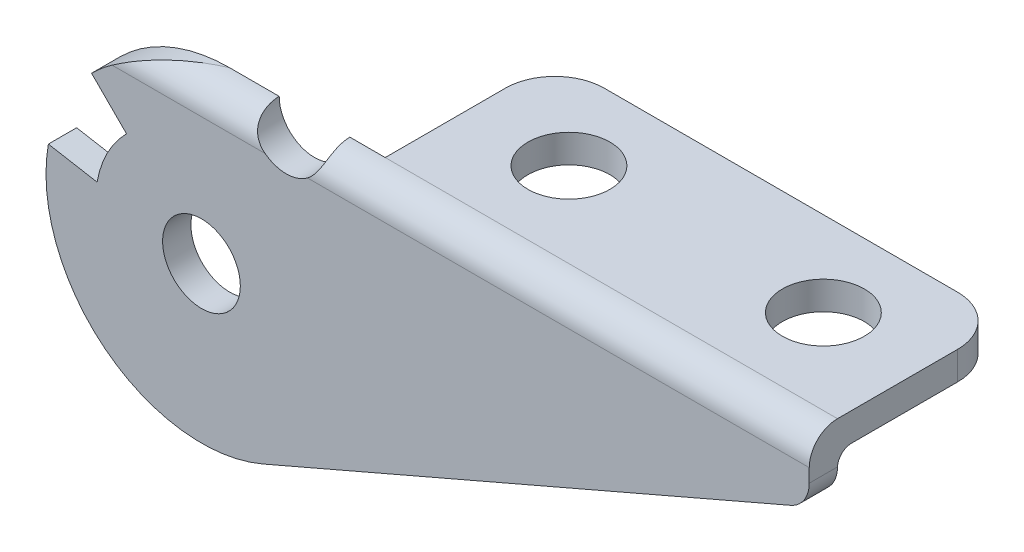
ISO-10303-21;
HEADER;
FILE_DESCRIPTION(('STEP AP214'),'2;1');
FILE_NAME('part.step','',(''),(''),'','','');
FILE_SCHEMA(('AUTOMOTIVE_DESIGN { 1 0 10303 214 1 1 1 1 }'));
ENDSEC;
DATA;
#1=APPLICATION_CONTEXT('core data for automotive mechanical design processes');
#2=APPLICATION_PROTOCOL_DEFINITION('international standard','automotive_design',2000,#1);
#3=PRODUCT_CONTEXT('',#1,'mechanical');
#4=PRODUCT('Part','Part','',(#3));
#5=PRODUCT_RELATED_PRODUCT_CATEGORY('part','',(#4));
#6=PRODUCT_DEFINITION_FORMATION('','',#4);
#7=PRODUCT_DEFINITION_CONTEXT('part definition',#1,'design');
#8=PRODUCT_DEFINITION('design','',#6,#7);
#9=PRODUCT_DEFINITION_SHAPE('','',#8);
#10=(LENGTH_UNIT() NAMED_UNIT(*) SI_UNIT(.MILLI.,.METRE.));
#11=(NAMED_UNIT(*) PLANE_ANGLE_UNIT() SI_UNIT($,.RADIAN.));
#12=(NAMED_UNIT(*) SI_UNIT($,.STERADIAN.) SOLID_ANGLE_UNIT());
#13=UNCERTAINTY_MEASURE_WITH_UNIT(LENGTH_MEASURE(1.E-05),#10,'distance_accuracy_value','');
#14=(GEOMETRIC_REPRESENTATION_CONTEXT(3) GLOBAL_UNCERTAINTY_ASSIGNED_CONTEXT((#13)) GLOBAL_UNIT_ASSIGNED_CONTEXT((#10,
#11,#12)) REPRESENTATION_CONTEXT('',''));
#15=CARTESIAN_POINT('',(0.,0.,0.));
#16=DIRECTION('',(0.,0.,1.));
#17=DIRECTION('',(1.,0.,0.));
#18=AXIS2_PLACEMENT_3D('',#15,#16,#17);
#19=CARTESIAN_POINT('',(65.,19.9999999999998,-2.00000000000017));
#20=DIRECTION('',(-1.,0.,0.));
#21=DIRECTION('',(0.,0.,1.));
#22=AXIS2_PLACEMENT_3D('',#19,#20,#21);
#23=CYLINDRICAL_SURFACE('',#22,2.00000000000017);
#24=DIRECTION('',(-1.,0.,0.));
#25=VECTOR('',#24,1.);
#26=CARTESIAN_POINT('',(11.,22.,-2.));
#27=LINE('',#26,#25);
#28=CARTESIAN_POINT('',(11.,22.,-2.));
#29=VERTEX_POINT('',#28);
#30=CARTESIAN_POINT('',(8.5,22.,-2.));
#31=VERTEX_POINT('',#30);
#32=EDGE_CURVE('E410',#29,#31,#27,.T.);
#33=ORIENTED_EDGE('',*,*,#32,.T.);
#34=CARTESIAN_POINT('',(8.5,22.,-2.00000000000017));
#35=CARTESIAN_POINT('',(8.49998623403591,22.0000052082364,-1.94411596343411));
#36=CARTESIAN_POINT('',(8.49999964649652,21.9976577329386,-1.88823451433974));
#37=CARTESIAN_POINT('',(8.49998062934849,21.9882977992406,-1.77686476050893));
#38=CARTESIAN_POINT('',(8.4999482006947,21.9812854380082,-1.72137644760794));
#39=CARTESIAN_POINT('',(8.49973722156801,21.9626282777389,-1.61113227562377));
#40=CARTESIAN_POINT('',(8.49955854833165,21.9509795910096,-1.55637707120322));
#41=CARTESIAN_POINT('',(8.4988567263354,21.9231445061616,-1.44805149509646));
#42=CARTESIAN_POINT('',(8.49833358190168,21.9069581650323,-1.39448110853901));
#43=CARTESIAN_POINT('',(8.49587538409059,21.8517093797935,-1.23602251258429));
#44=CARTESIAN_POINT('',(8.49305158681054,21.8059566386776,-1.13338372101176));
#45=CARTESIAN_POINT('',(8.48229197621091,21.6981033887068,-0.937480897454113));
#46=CARTESIAN_POINT('',(8.47435937965175,21.6360131812932,-0.844211009018763));
#47=CARTESIAN_POINT('',(8.45034655230726,21.4995358522963,-0.672174439364921));
#48=CARTESIAN_POINT('',(8.43448151185625,21.4255067794627,-0.593095998168248));
#49=CARTESIAN_POINT('',(8.39166624436146,21.2674745108016,-0.449227241582224));
#50=CARTESIAN_POINT('',(8.36472670290294,21.1834809849188,-0.384423245355666));
#51=CARTESIAN_POINT('',(8.30076142542584,21.0183816591358,-0.276131779267807));
#52=CARTESIAN_POINT('',(8.26492775203415,20.9377516329866,-0.23120960611453));
#53=CARTESIAN_POINT('',(8.18183081453151,20.7761297672366,-0.154567026996686));
#54=CARTESIAN_POINT('',(8.13456827596864,20.6951379509239,-0.122845783334301));
#55=CARTESIAN_POINT('',(8.03096882786509,20.5393042001362,-0.0723993675378584));
#56=CARTESIAN_POINT('',(7.97499999110441,20.4643465528663,-0.0532646806337237));
#57=CARTESIAN_POINT('',(7.85394680197467,20.3201960215158,-0.0244282236659396));
#58=CARTESIAN_POINT('',(7.78885922882197,20.2510051881348,-0.0147297961945898));
#59=CARTESIAN_POINT('',(7.6850855983473,20.152622736415,-0.00555517635278587));
#60=CARTESIAN_POINT('',(7.64926144951835,20.120571939255,-0.00339562144285477));
#61=CARTESIAN_POINT('',(7.57589994258271,20.058651434327,-0.00062151939867653));
#62=CARTESIAN_POINT('',(7.5383680255821,20.0287754933537,-2.37331825222993E-06));
#63=CARTESIAN_POINT('',(7.5,20.,0.));
#64=B_SPLINE_CURVE_WITH_KNOTS('',3,(#34,#35,#36,#37,#38,#39,#40,#41,#42,#43,#44,#45,#46,#47,#48,
#49,#50,#51,#52,#53,#54,#55,#56,#57,#58,#59,#60,#61,#62,#63),.UNSPECIFIED.,.F.,.F.,(4,2,2,2,2,2,
2,2,2,2,2,2,2,2,4),(0.,0.167598122599452,0.33519275430103,0.502928216005781,0.670661571184234,
1.00611882844517,1.34136507095187,1.6679736704555,1.99426786817367,2.28976294947521,
2.58523927654095,2.8705515578588,3.15596486817117,3.30022943936508,3.44406278382542),.UNSPECIFIED.);
#65=CARTESIAN_POINT('',(7.49999999999977,19.9999999999998,0.));
#66=VERTEX_POINT('',#65);
#67=EDGE_CURVE('E11',#31,#66,#64,.T.);
#68=ORIENTED_EDGE('',*,*,#67,.T.);
#69=DIRECTION('',(-1.,0.,0.));
#70=VECTOR('',#69,1.);
#71=CARTESIAN_POINT('',(65.,20.,0.));
#72=LINE('',#71,#70);
#73=CARTESIAN_POINT('',(43.,20.,0.));
#74=VERTEX_POINT('',#73);
#75=EDGE_CURVE('E177',#74,#66,#72,.T.);
#76=ORIENTED_EDGE('',*,*,#75,.F.);
#77=CARTESIAN_POINT('',(43.,19.9999999999998,-2.00000000000017));
#78=DIRECTION('',(1.,0.,0.));
#79=DIRECTION('',(0.,0.,-1.));
#80=AXIS2_PLACEMENT_3D('',#77,#78,#79);
#81=CIRCLE('',#80,2.00000000000017);
#82=CARTESIAN_POINT('',(43.,22.,-2.));
#83=VERTEX_POINT('',#82);
#84=EDGE_CURVE('E215',#74,#83,#81,.F.);
#85=ORIENTED_EDGE('',*,*,#84,.T.);
#86=DIRECTION('',(-1.,0.,0.));
#87=VECTOR('',#86,1.);
#88=CARTESIAN_POINT('',(65.,22.,-2.));
#89=LINE('',#88,#87);
#90=EDGE_CURVE('E185',#83,#29,#89,.T.);
#91=ORIENTED_EDGE('',*,*,#90,.T.);
#92=EDGE_LOOP('',(#33,#68,#76,#85,#91));
#93=FACE_BOUND('',#92,.T.);
#94=ADVANCED_FACE('F37',(#93),#23,.T.);
#95=CARTESIAN_POINT('',(43.,22.,-14.));
#96=DIRECTION('',(0.,1.,0.));
#97=DIRECTION('',(0.,0.,1.));
#98=AXIS2_PLACEMENT_3D('',#95,#96,#97);
#99=PLANE('',#98);
#100=CARTESIAN_POINT('',(18.,22.,-8.));
#101=DIRECTION('',(0.,1.,0.));
#102=DIRECTION('',(0.,0.,1.));
#103=AXIS2_PLACEMENT_3D('',#100,#101,#102);
#104=CIRCLE('',#103,2.9);
#105=CARTESIAN_POINT('',(18.,22.,-5.1));
#106=VERTEX_POINT('',#105);
#107=EDGE_CURVE('E342',#106,#106,#104,.F.);
#108=ORIENTED_EDGE('',*,*,#107,.T.);
#109=EDGE_LOOP('',(#108));
#110=FACE_BOUND('',#109,.T.);
#111=CARTESIAN_POINT('',(39.5000000000003,22.,-10.5000000000003));
#112=DIRECTION('',(0.,1.,0.));
#113=DIRECTION('',(0.,0.,1.));
#114=AXIS2_PLACEMENT_3D('',#111,#112,#113);
#115=CIRCLE('',#114,3.49999999999972);
#116=CARTESIAN_POINT('',(43.,22.,-10.5));
#117=VERTEX_POINT('',#116);
#118=CARTESIAN_POINT('',(39.5,22.,-14.));
#119=VERTEX_POINT('',#118);
#120=EDGE_CURVE('E327',#117,#119,#115,.T.);
#121=ORIENTED_EDGE('',*,*,#120,.T.);
#122=DIRECTION('',(-1.,0.,0.));
#123=VECTOR('',#122,1.);
#124=CARTESIAN_POINT('',(43.,22.,-14.));
#125=LINE('',#124,#123);
#126=CARTESIAN_POINT('',(14.5,22.,-14.));
#127=VERTEX_POINT('',#126);
#128=EDGE_CURVE('E338',#119,#127,#125,.T.);
#129=ORIENTED_EDGE('',*,*,#128,.T.);
#130=CARTESIAN_POINT('',(14.4999999999997,22.,-10.5000000000003));
#131=DIRECTION('',(0.,1.,0.));
#132=DIRECTION('',(0.,0.,1.));
#133=AXIS2_PLACEMENT_3D('',#130,#131,#132);
#134=CIRCLE('',#133,3.49999999999971);
#135=CARTESIAN_POINT('',(11.,22.,-10.5));
#136=VERTEX_POINT('',#135);
#137=EDGE_CURVE('E341',#127,#136,#134,.T.);
#138=ORIENTED_EDGE('',*,*,#137,.T.);
#139=DIRECTION('',(0.,0.,1.));
#140=VECTOR('',#139,1.);
#141=CARTESIAN_POINT('',(11.,22.,-10.5));
#142=LINE('',#141,#140);
#143=EDGE_CURVE('E449',#136,#29,#142,.T.);
#144=ORIENTED_EDGE('',*,*,#143,.T.);
#145=ORIENTED_EDGE('',*,*,#90,.F.);
#146=DIRECTION('',(0.,0.,1.));
#147=VECTOR('',#146,1.);
#148=CARTESIAN_POINT('',(43.,22.,-14.));
#149=LINE('',#148,#147);
#150=EDGE_CURVE('E340',#117,#83,#149,.T.);
#151=ORIENTED_EDGE('',*,*,#150,.F.);
#152=EDGE_LOOP('',(#121,#129,#138,#144,#145,#151));
#153=FACE_BOUND('',#152,.T.);
#154=CARTESIAN_POINT('',(36.,22.,-8.));
#155=DIRECTION('',(0.,1.,0.));
#156=DIRECTION('',(0.,0.,1.));
#157=AXIS2_PLACEMENT_3D('',#154,#155,#156);
#158=CIRCLE('',#157,2.9);
#159=CARTESIAN_POINT('',(36.,22.,-5.1));
#160=VERTEX_POINT('',#159);
#161=EDGE_CURVE('E436',#160,#160,#158,.F.);
#162=ORIENTED_EDGE('',*,*,#161,.T.);
#163=EDGE_LOOP('',(#162));
#164=FACE_BOUND('',#163,.T.);
#165=ADVANCED_FACE('F238',(#110,#153,#164),#99,.T.);
#166=CARTESIAN_POINT('',(65.,20.,-3.));
#167=DIRECTION('',(0.,1.,0.));
#168=DIRECTION('',(0.,0.,1.));
#169=AXIS2_PLACEMENT_3D('',#166,#167,#168);
#170=PLANE('',#169);
#171=CARTESIAN_POINT('',(18.,20.,-8.));
#172=DIRECTION('',(0.,1.,0.));
#173=DIRECTION('',(0.,0.,1.));
#174=AXIS2_PLACEMENT_3D('',#171,#172,#173);
#175=CIRCLE('',#174,2.9);
#176=CARTESIAN_POINT('',(18.,20.,-5.1));
#177=VERTEX_POINT('',#176);
#178=EDGE_CURVE('E441',#177,#177,#175,.T.);
#179=ORIENTED_EDGE('',*,*,#178,.T.);
#180=EDGE_LOOP('',(#179));
#181=FACE_BOUND('',#180,.T.);
#182=DIRECTION('',(-1.,0.,0.));
#183=VECTOR('',#182,1.);
#184=CARTESIAN_POINT('',(0.,20.,-14.));
#185=LINE('',#184,#183);
#186=CARTESIAN_POINT('',(39.5,20.,-14.));
#187=VERTEX_POINT('',#186);
#188=CARTESIAN_POINT('',(14.5,20.,-14.));
#189=VERTEX_POINT('',#188);
#190=EDGE_CURVE('E262',#187,#189,#185,.T.);
#191=ORIENTED_EDGE('',*,*,#190,.F.);
#192=CARTESIAN_POINT('',(39.5000000000003,20.,-10.5000000000003));
#193=DIRECTION('',(0.,1.,0.));
#194=DIRECTION('',(0.,0.,1.));
#195=AXIS2_PLACEMENT_3D('',#192,#193,#194);
#196=CIRCLE('',#195,3.49999999999972);
#197=CARTESIAN_POINT('',(43.,20.,-10.5000000000003));
#198=VERTEX_POINT('',#197);
#199=EDGE_CURVE('E168',#187,#198,#196,.F.);
#200=ORIENTED_EDGE('',*,*,#199,.T.);
#201=DIRECTION('',(0.,0.,1.));
#202=VECTOR('',#201,1.);
#203=CARTESIAN_POINT('',(43.,20.,-14.));
#204=LINE('',#203,#202);
#205=CARTESIAN_POINT('',(43.,20.,-3.));
#206=VERTEX_POINT('',#205);
#207=EDGE_CURVE('E224',#198,#206,#204,.T.);
#208=ORIENTED_EDGE('',*,*,#207,.T.);
#209=DIRECTION('',(-1.,0.,0.));
#210=VECTOR('',#209,1.);
#211=CARTESIAN_POINT('',(65.,20.,-3.));
#212=LINE('',#211,#210);
#213=CARTESIAN_POINT('',(11.,20.,-3.));
#214=VERTEX_POINT('',#213);
#215=EDGE_CURVE('E193',#206,#214,#212,.T.);
#216=ORIENTED_EDGE('',*,*,#215,.T.);
#217=DIRECTION('',(0.,0.,-1.));
#218=VECTOR('',#217,1.);
#219=CARTESIAN_POINT('',(11.,20.,-3.));
#220=LINE('',#219,#218);
#221=CARTESIAN_POINT('',(11.,20.,-10.5));
#222=VERTEX_POINT('',#221);
#223=EDGE_CURVE('E183',#214,#222,#220,.T.);
#224=ORIENTED_EDGE('',*,*,#223,.T.);
#225=CARTESIAN_POINT('',(14.4999999999997,20.,-10.5000000000003));
#226=DIRECTION('',(0.,1.,0.));
#227=DIRECTION('',(0.,0.,1.));
#228=AXIS2_PLACEMENT_3D('',#225,#226,#227);
#229=CIRCLE('',#228,3.49999999999971);
#230=EDGE_CURVE('E261',#222,#189,#229,.F.);
#231=ORIENTED_EDGE('',*,*,#230,.T.);
#232=EDGE_LOOP('',(#191,#200,#208,#216,#224,#231));
#233=FACE_BOUND('',#232,.T.);
#234=CARTESIAN_POINT('',(36.,20.,-8.));
#235=DIRECTION('',(0.,1.,0.));
#236=DIRECTION('',(0.,0.,1.));
#237=AXIS2_PLACEMENT_3D('',#234,#235,#236);
#238=CIRCLE('',#237,2.9);
#239=CARTESIAN_POINT('',(36.,20.,-5.1));
#240=VERTEX_POINT('',#239);
#241=EDGE_CURVE('E439',#240,#240,#238,.T.);
#242=ORIENTED_EDGE('',*,*,#241,.T.);
#243=EDGE_LOOP('',(#242));
#244=FACE_BOUND('',#243,.T.);
#245=ADVANCED_FACE('F241',(#181,#233,#244),#170,.F.);
#246=CARTESIAN_POINT('',(43.,19.045884968713,-14.));
#247=DIRECTION('',(1.,0.,0.));
#248=DIRECTION('',(0.,0.,-1.));
#249=AXIS2_PLACEMENT_3D('',#246,#247,#248);
#250=PLANE('',#249);
#251=ORIENTED_EDGE('',*,*,#207,.F.);
#252=DIRECTION('',(0.,-1.,0.));
#253=VECTOR('',#252,1.);
#254=CARTESIAN_POINT('',(43.,22.,-10.5));
#255=LINE('',#254,#253);
#256=EDGE_CURVE('E66',#117,#198,#255,.T.);
#257=ORIENTED_EDGE('',*,*,#256,.F.);
#258=ORIENTED_EDGE('',*,*,#150,.T.);
#259=ORIENTED_EDGE('',*,*,#84,.F.);
#260=DIRECTION('',(0.,1.,0.));
#261=VECTOR('',#260,1.);
#262=CARTESIAN_POINT('',(43.,19.045884968713,0.));
#263=LINE('',#262,#261);
#264=CARTESIAN_POINT('',(43.,19.045884968713,0.));
#265=VERTEX_POINT('',#264);
#266=EDGE_CURVE('E365',#265,#74,#263,.T.);
#267=ORIENTED_EDGE('',*,*,#266,.F.);
#268=DIRECTION('',(0.,0.,1.));
#269=VECTOR('',#268,1.);
#270=CARTESIAN_POINT('',(43.,19.045884968713,-14.));
#271=LINE('',#270,#269);
#272=CARTESIAN_POINT('',(43.,19.045884968713,-2.00105326986557));
#273=VERTEX_POINT('',#272);
#274=EDGE_CURVE('E383',#273,#265,#271,.T.);
#275=ORIENTED_EDGE('',*,*,#274,.F.);
#276=CARTESIAN_POINT('',(43.,19.0000000000007,-2.99999999999931));
#277=DIRECTION('',(1.,0.,0.));
#278=DIRECTION('',(0.,0.,-1.));
#279=AXIS2_PLACEMENT_3D('',#276,#277,#278);
#280=CIRCLE('',#279,0.999999999999314);
#281=EDGE_CURVE('E391',#206,#273,#280,.T.);
#282=ORIENTED_EDGE('',*,*,#281,.F.);
#283=EDGE_LOOP('',(#251,#257,#258,#259,#267,#275,#282));
#284=FACE_BOUND('',#283,.T.);
#285=ADVANCED_FACE('F243',(#284),#250,.T.);
#286=CARTESIAN_POINT('',(0.,10.9999999999996,-14.));
#287=DIRECTION('',(0.,0.,1.));
#288=DIRECTION('',(1.,0.,0.));
#289=AXIS2_PLACEMENT_3D('',#286,#287,#288);
#290=PLANE('',#289);
#291=DIRECTION('',(0.,-1.,0.));
#292=VECTOR('',#291,1.);
#293=CARTESIAN_POINT('',(39.5,22.,-14.));
#294=LINE('',#293,#292);
#295=EDGE_CURVE('E325',#119,#187,#294,.T.);
#296=ORIENTED_EDGE('',*,*,#295,.T.);
#297=ORIENTED_EDGE('',*,*,#190,.T.);
#298=DIRECTION('',(0.,-1.,0.));
#299=VECTOR('',#298,1.);
#300=CARTESIAN_POINT('',(14.5,22.,-14.));
#301=LINE('',#300,#299);
#302=EDGE_CURVE('E331',#127,#189,#301,.T.);
#303=ORIENTED_EDGE('',*,*,#302,.F.);
#304=ORIENTED_EDGE('',*,*,#128,.F.);
#305=EDGE_LOOP('',(#296,#297,#303,#304));
#306=FACE_BOUND('',#305,.T.);
#307=ADVANCED_FACE('F246',(#306),#290,.F.);
#308=CARTESIAN_POINT('',(0.,10.9999999999996,-14.));
#309=DIRECTION('',(0.,0.,1.));
#310=DIRECTION('',(1.,0.,0.));
#311=AXIS2_PLACEMENT_3D('',#308,#309,#310);
#312=CYLINDRICAL_SURFACE('',#311,10.9999999999997);
#313=DIRECTION('',(0.,0.,1.));
#314=VECTOR('',#313,1.);
#315=CARTESIAN_POINT('',(-10.832885283134,12.910129954336,-14.));
#316=LINE('',#315,#314);
#317=CARTESIAN_POINT('',(-10.832885283134,12.910129954336,-2.));
#318=VERTEX_POINT('',#317);
#319=CARTESIAN_POINT('',(-10.832885283134,12.910129954336,0.));
#320=VERTEX_POINT('',#319);
#321=EDGE_CURVE('E374',#318,#320,#316,.T.);
#322=ORIENTED_EDGE('',*,*,#321,.F.);
#323=CARTESIAN_POINT('',(0.,10.9999999999996,-2.));
#324=DIRECTION('',(0.,0.,1.));
#325=DIRECTION('',(1.,0.,0.));
#326=AXIS2_PLACEMENT_3D('',#323,#324,#325);
#327=CIRCLE('',#326,10.9999999999997);
#328=CARTESIAN_POINT('',(4.3637860962121,0.90260573679992,-2.));
#329=VERTEX_POINT('',#328);
#330=EDGE_CURVE('E204',#329,#318,#327,.F.);
#331=ORIENTED_EDGE('',*,*,#330,.F.);
#332=DIRECTION('',(0.,0.,1.));
#333=VECTOR('',#332,1.);
#334=CARTESIAN_POINT('',(4.3637860962121,0.90260573679992,-14.));
#335=LINE('',#334,#333);
#336=CARTESIAN_POINT('',(4.3637860962121,0.90260573679992,0.));
#337=VERTEX_POINT('',#336);
#338=EDGE_CURVE('E345',#329,#337,#335,.T.);
#339=ORIENTED_EDGE('',*,*,#338,.T.);
#340=CARTESIAN_POINT('',(0.,10.9999999999996,0.));
#341=DIRECTION('',(0.,0.,1.));
#342=DIRECTION('',(1.,0.,0.));
#343=AXIS2_PLACEMENT_3D('',#340,#341,#342);
#344=CIRCLE('',#343,10.9999999999997);
#345=EDGE_CURVE('E357',#320,#337,#344,.T.);
#346=ORIENTED_EDGE('',*,*,#345,.F.);
#347=EDGE_LOOP('',(#322,#331,#339,#346));
#348=FACE_BOUND('',#347,.T.);
#349=ADVANCED_FACE('F39',(#348),#312,.T.);
#350=CARTESIAN_POINT('',(-7.3860581475916,12.302361332502,-14.));
#351=DIRECTION('',(0.173648177666876,0.984807753012218,0.));
#352=DIRECTION('',(-0.984807753012218,0.173648177666876,0.));
#353=AXIS2_PLACEMENT_3D('',#350,#351,#352);
#354=PLANE('',#353);
#355=DIRECTION('',(0.984807753012218,-0.173648177666876,0.));
#356=VECTOR('',#355,1.);
#357=CARTESIAN_POINT('',(-7.3860581475916,12.302361332502,-2.));
#358=LINE('',#357,#356);
#359=CARTESIAN_POINT('',(-7.3860581475916,12.302361332502,-2.));
#360=VERTEX_POINT('',#359);
#361=EDGE_CURVE('E206',#318,#360,#358,.T.);
#362=ORIENTED_EDGE('',*,*,#361,.F.);
#363=ORIENTED_EDGE('',*,*,#321,.T.);
#364=DIRECTION('',(-0.984807753012218,0.173648177666876,0.));
#365=VECTOR('',#364,1.);
#366=CARTESIAN_POINT('',(-7.3860581475916,12.302361332502,0.));
#367=LINE('',#366,#365);
#368=CARTESIAN_POINT('',(-7.3860581475916,12.302361332502,0.));
#369=VERTEX_POINT('',#368);
#370=EDGE_CURVE('E346',#369,#320,#367,.T.);
#371=ORIENTED_EDGE('',*,*,#370,.F.);
#372=DIRECTION('',(0.,0.,1.));
#373=VECTOR('',#372,1.);
#374=CARTESIAN_POINT('',(-7.3860581475916,12.302361332502,-14.));
#375=LINE('',#374,#373);
#376=EDGE_CURVE('E376',#360,#369,#375,.T.);
#377=ORIENTED_EDGE('',*,*,#376,.F.);
#378=EDGE_LOOP('',(#362,#363,#371,#377));
#379=FACE_BOUND('',#378,.T.);
#380=ADVANCED_FACE('F283',(#379),#354,.T.);
#381=CARTESIAN_POINT('',(0.,10.9999999999996,-14.));
#382=DIRECTION('',(0.,0.,1.));
#383=DIRECTION('',(1.,0.,0.));
#384=AXIS2_PLACEMENT_3D('',#381,#382,#383);
#385=CYLINDRICAL_SURFACE('',#384,7.50000000000009);
#386=CARTESIAN_POINT('',(0.,10.9999999999996,-2.));
#387=DIRECTION('',(0.,0.,1.));
#388=DIRECTION('',(1.,0.,0.));
#389=AXIS2_PLACEMENT_3D('',#386,#387,#388);
#390=CIRCLE('',#389,7.50000000000009);
#391=CARTESIAN_POINT('',(-5.30330085889906,16.303300858899,-2.));
#392=VERTEX_POINT('',#391);
#393=EDGE_CURVE('E208',#360,#392,#390,.F.);
#394=ORIENTED_EDGE('',*,*,#393,.F.);
#395=ORIENTED_EDGE('',*,*,#376,.T.);
#396=CARTESIAN_POINT('',(0.,10.9999999999996,0.));
#397=DIRECTION('',(0.,0.,1.));
#398=DIRECTION('',(1.,0.,0.));
#399=AXIS2_PLACEMENT_3D('',#396,#397,#398);
#400=CIRCLE('',#399,7.50000000000009);
#401=CARTESIAN_POINT('',(-5.30330085889906,16.303300858899,0.));
#402=VERTEX_POINT('',#401);
#403=EDGE_CURVE('E352',#402,#369,#400,.T.);
#404=ORIENTED_EDGE('',*,*,#403,.F.);
#405=DIRECTION('',(0.,0.,1.));
#406=VECTOR('',#405,1.);
#407=CARTESIAN_POINT('',(-5.30330085889906,16.303300858899,-14.));
#408=LINE('',#407,#406);
#409=EDGE_CURVE('E378',#392,#402,#408,.T.);
#410=ORIENTED_EDGE('',*,*,#409,.F.);
#411=EDGE_LOOP('',(#394,#395,#404,#410));
#412=FACE_BOUND('',#411,.T.);
#413=ADVANCED_FACE('F285',(#412),#385,.T.);
#414=CARTESIAN_POINT('',(-7.778174593052,18.778174593052,-14.));
#415=DIRECTION('',(-0.707106781186562,-0.707106781186533,0.));
#416=DIRECTION('',(0.707106781186533,-0.707106781186562,0.));
#417=AXIS2_PLACEMENT_3D('',#414,#415,#416);
#418=PLANE('',#417);
#419=DIRECTION('',(-0.707106781186533,0.707106781186562,0.));
#420=VECTOR('',#419,1.);
#421=CARTESIAN_POINT('',(-7.778174593052,18.778174593052,-2.));
#422=LINE('',#421,#420);
#423=CARTESIAN_POINT('',(-7.778174593052,18.778174593052,-2.));
#424=VERTEX_POINT('',#423);
#425=EDGE_CURVE('E210',#392,#424,#422,.T.);
#426=ORIENTED_EDGE('',*,*,#425,.F.);
#427=ORIENTED_EDGE('',*,*,#409,.T.);
#428=DIRECTION('',(0.707106781186533,-0.707106781186562,0.));
#429=VECTOR('',#428,1.);
#430=CARTESIAN_POINT('',(-7.778174593052,18.778174593052,0.));
#431=LINE('',#430,#429);
#432=CARTESIAN_POINT('',(-7.778174593052,18.778174593052,0.));
#433=VERTEX_POINT('',#432);
#434=EDGE_CURVE('E369',#433,#402,#431,.T.);
#435=ORIENTED_EDGE('',*,*,#434,.F.);
#436=DIRECTION('',(0.,0.,1.));
#437=VECTOR('',#436,1.);
#438=CARTESIAN_POINT('',(-7.778174593052,18.778174593052,-14.));
#439=LINE('',#438,#437);
#440=EDGE_CURVE('E380',#424,#433,#439,.T.);
#441=ORIENTED_EDGE('',*,*,#440,.F.);
#442=EDGE_LOOP('',(#426,#427,#435,#441));
#443=FACE_BOUND('',#442,.T.);
#444=ADVANCED_FACE('F235',(#443),#418,.T.);
#445=CARTESIAN_POINT('',(0.,10.9999999999996,-14.));
#446=DIRECTION('',(0.,0.,1.));
#447=DIRECTION('',(1.,0.,0.));
#448=AXIS2_PLACEMENT_3D('',#445,#446,#447);
#449=CYLINDRICAL_SURFACE('',#448,11.0000000000003);
#450=CARTESIAN_POINT('',(-6.32455532033679,20.,0.));
#451=CARTESIAN_POINT('',(-6.25489918919124,20.0489508637085,-5.47868882778222E-06));
#452=CARTESIAN_POINT('',(-6.18469049830112,20.0970787841166,-0.00179640688328115));
#453=CARTESIAN_POINT('',(-6.04330662014122,20.1916086066036,-0.00863474571158779));
#454=CARTESIAN_POINT('',(-5.97213174577461,20.2380110501028,-0.0136811255727728));
#455=CARTESIAN_POINT('',(-5.75757977328971,20.3743772723096,-0.0332084063682506));
#456=CARTESIAN_POINT('',(-5.61290134434757,20.461692332433,-0.052079952126234));
#457=CARTESIAN_POINT('',(-5.32183690900669,20.6283967239912,-0.099322103204998));
#458=CARTESIAN_POINT('',(-5.17546698094455,20.7078317014451,-0.127633283890167));
#459=CARTESIAN_POINT('',(-4.88059973541288,20.8593735720994,-0.19216731348152));
#460=CARTESIAN_POINT('',(-4.73210109506164,20.9314756611179,-0.228395300816033));
#461=CARTESIAN_POINT('',(-4.33226684519794,21.1147112743073,-0.334163268444505));
#462=CARTESIAN_POINT('',(-4.07943005542176,21.2191878822442,-0.409641797935392));
#463=CARTESIAN_POINT('',(-3.57059310680735,21.4079094822082,-0.574009507417414));
#464=CARTESIAN_POINT('',(-3.31459155051142,21.4921451746551,-0.662904821257057));
#465=CARTESIAN_POINT('',(-2.79957204624991,21.6411698583994,-0.8506645960951));
#466=CARTESIAN_POINT('',(-2.54054679009158,21.7058915709864,-0.949562011635051));
#467=CARTESIAN_POINT('',(-2.02116492317854,21.8159760583236,-1.15400755014688));
#468=CARTESIAN_POINT('',(-1.76080886289505,21.8613462704361,-1.25955310010956));
#469=CARTESIAN_POINT('',(-1.25353648016529,21.9311737697421,-1.4689004268107));
#470=CARTESIAN_POINT('',(-1.00666555314831,21.9566408719271,-1.57248078307738));
#471=CARTESIAN_POINT('',(-0.51294061089727,21.9908145009485,-1.78130243909877));
#472=CARTESIAN_POINT('',(-0.266087320400706,21.9995502471442,-1.88654051907186));
#473=CARTESIAN_POINT('',(-0.0128634778518914,21.9999943571515,-1.99451499529121));
#474=CARTESIAN_POINT('',(-0.00643171575254837,21.9999999979886,-1.9972575079085));
#475=CARTESIAN_POINT('',(0.,21.9999999999999,-2.00000000000017));
#476=B_SPLINE_CURVE_WITH_KNOTS('',3,(#450,#451,#452,#453,#454,#455,#456,#457,#458,#459,#460,
#461,#462,#463,#464,#465,#466,#467,#468,#469,#470,#471,#472,#473,#474,#475),.UNSPECIFIED.,.F.,
.F.,(4,2,2,2,2,2,2,2,2,2,2,2,4),(0.,0.255349429055304,0.510618046555625,1.02015427333721,
1.52654158205435,2.03325854444826,2.88332291939342,3.73377710827099,4.58713074947004,
5.44015612508413,6.24643382280112,7.05130216216727,7.07227834595726),.UNSPECIFIED.);
#477=CARTESIAN_POINT('',(0.,22.,-2.));
#478=VERTEX_POINT('',#477);
#479=CARTESIAN_POINT('',(-6.32455532033703,19.9999999999998,0.));
#480=VERTEX_POINT('',#479);
#481=EDGE_CURVE('E181',#478,#480,#476,.F.);
#482=ORIENTED_EDGE('',*,*,#481,.F.);
#483=CARTESIAN_POINT('',(0.,10.9999999999996,-2.));
#484=DIRECTION('',(0.,0.,1.));
#485=DIRECTION('',(1.,0.,0.));
#486=AXIS2_PLACEMENT_3D('',#483,#484,#485);
#487=CIRCLE('',#486,11.0000000000003);
#488=EDGE_CURVE('E212',#424,#478,#487,.F.);
#489=ORIENTED_EDGE('',*,*,#488,.F.);
#490=ORIENTED_EDGE('',*,*,#440,.T.);
#491=CARTESIAN_POINT('',(0.,10.9999999999996,0.));
#492=DIRECTION('',(0.,0.,1.));
#493=DIRECTION('',(1.,0.,0.));
#494=AXIS2_PLACEMENT_3D('',#491,#492,#493);
#495=CIRCLE('',#494,11.0000000000003);
#496=EDGE_CURVE('E367',#480,#433,#495,.T.);
#497=ORIENTED_EDGE('',*,*,#496,.F.);
#498=EDGE_LOOP('',(#482,#489,#490,#497));
#499=FACE_BOUND('',#498,.T.);
#500=ADVANCED_FACE('F229',(#499),#449,.T.);
#501=CARTESIAN_POINT('',(40.7999999999963,19.0458849687157,-14.));
#502=DIRECTION('',(0.,0.,1.));
#503=DIRECTION('',(1.,0.,0.));
#504=AXIS2_PLACEMENT_3D('',#501,#502,#503);
#505=CYLINDRICAL_SURFACE('',#504,2.20000000000374);
#506=CARTESIAN_POINT('',(40.7999999999963,19.0458849687157,-2.));
#507=DIRECTION('',(0.,0.,1.));
#508=DIRECTION('',(1.,0.,0.));
#509=AXIS2_PLACEMENT_3D('',#506,#507,#508);
#510=CIRCLE('',#509,2.20000000000374);
#511=CARTESIAN_POINT('',(42.9995214410517,19.,-2.));
#512=VERTEX_POINT('',#511);
#513=CARTESIAN_POINT('',(41.672757219242,17.026406116073,-2.));
#514=VERTEX_POINT('',#513);
#515=EDGE_CURVE('E202',#512,#514,#510,.F.);
#516=ORIENTED_EDGE('',*,*,#515,.F.);
#517=CARTESIAN_POINT('',(43.,19.045884968713,-2.00105326986557));
#518=CARTESIAN_POINT('',(43.000000039852,19.0382406711215,-2.00070218393407));
#519=CARTESIAN_POINT('',(42.9999601798657,19.030594774933,-2.00043886847952));
#520=CARTESIAN_POINT('',(42.9998006602163,19.015299785362,-2.00008777852433));
#521=CARTESIAN_POINT('',(42.9996810005532,19.0076506919795,-2.00000000402369));
#522=CARTESIAN_POINT('',(42.9995214410517,19.,-2.));
#523=B_SPLINE_CURVE_WITH_KNOTS('',3,(#517,#518,#519,#520,#521,#522),.UNSPECIFIED.,.F.,.F.,(4,2,
4),(0.,0.0229515984487062,0.0459031968974116),.UNSPECIFIED.);
#524=EDGE_CURVE('E253',#273,#512,#523,.T.);
#525=ORIENTED_EDGE('',*,*,#524,.F.);
#526=ORIENTED_EDGE('',*,*,#274,.T.);
#527=CARTESIAN_POINT('',(40.7999999999963,19.0458849687157,0.));
#528=DIRECTION('',(0.,0.,1.));
#529=DIRECTION('',(1.,0.,0.));
#530=AXIS2_PLACEMENT_3D('',#527,#528,#529);
#531=CIRCLE('',#530,2.20000000000374);
#532=CARTESIAN_POINT('',(41.672757219242,17.026406116073,0.));
#533=VERTEX_POINT('',#532);
#534=EDGE_CURVE('E362',#533,#265,#531,.T.);
#535=ORIENTED_EDGE('',*,*,#534,.F.);
#536=DIRECTION('',(0.,0.,1.));
#537=VECTOR('',#536,1.);
#538=CARTESIAN_POINT('',(41.672757219242,17.026406116073,-14.));
#539=LINE('',#538,#537);
#540=EDGE_CURVE('E349',#514,#533,#539,.T.);
#541=ORIENTED_EDGE('',*,*,#540,.F.);
#542=EDGE_LOOP('',(#516,#525,#526,#535,#541));
#543=FACE_BOUND('',#542,.T.);
#544=ADVANCED_FACE('F234',(#543),#505,.T.);
#545=CARTESIAN_POINT('',(4.3637860962121,0.90260573679992,-14.));
#546=DIRECTION('',(0.39670782692837,-0.91794493301819,0.));
#547=DIRECTION('',(0.917944933018191,0.39670782692837,0.));
#548=AXIS2_PLACEMENT_3D('',#545,#546,#547);
#549=PLANE('',#548);
#550=DIRECTION('',(-0.917944933018191,-0.39670782692837,0.));
#551=VECTOR('',#550,1.);
#552=CARTESIAN_POINT('',(4.3637860962121,0.90260573679992,-2.));
#553=LINE('',#552,#551);
#554=EDGE_CURVE('E200',#514,#329,#553,.T.);
#555=ORIENTED_EDGE('',*,*,#554,.F.);
#556=ORIENTED_EDGE('',*,*,#540,.T.);
#557=DIRECTION('',(0.917944933018191,0.39670782692837,0.));
#558=VECTOR('',#557,1.);
#559=CARTESIAN_POINT('',(4.3637860962121,0.90260573679992,0.));
#560=LINE('',#559,#558);
#561=EDGE_CURVE('E359',#337,#533,#560,.T.);
#562=ORIENTED_EDGE('',*,*,#561,.F.);
#563=ORIENTED_EDGE('',*,*,#338,.F.);
#564=EDGE_LOOP('',(#555,#556,#562,#563));
#565=FACE_BOUND('',#564,.T.);
#566=ADVANCED_FACE('F250',(#565),#549,.T.);
#567=CARTESIAN_POINT('',(0.,10.9999999999996,0.));
#568=DIRECTION('',(0.,0.,1.));
#569=DIRECTION('',(1.,0.,0.));
#570=AXIS2_PLACEMENT_3D('',#567,#568,#569);
#571=PLANE('',#570);
#572=CARTESIAN_POINT('',(6.,22.,0.));
#573=DIRECTION('',(0.,0.,1.));
#574=DIRECTION('',(1.,0.,0.));
#575=AXIS2_PLACEMENT_3D('',#572,#573,#574);
#576=CIRCLE('',#575,2.5);
#577=CARTESIAN_POINT('',(4.50000000000023,19.9999999999998,0.));
#578=VERTEX_POINT('',#577);
#579=EDGE_CURVE('E164',#578,#66,#576,.T.);
#580=ORIENTED_EDGE('',*,*,#579,.F.);
#581=EDGE_CURVE('E174',#578,#480,#72,.T.);
#582=ORIENTED_EDGE('',*,*,#581,.T.);
#583=ORIENTED_EDGE('',*,*,#496,.T.);
#584=ORIENTED_EDGE('',*,*,#434,.T.);
#585=ORIENTED_EDGE('',*,*,#403,.T.);
#586=ORIENTED_EDGE('',*,*,#370,.T.);
#587=ORIENTED_EDGE('',*,*,#345,.T.);
#588=ORIENTED_EDGE('',*,*,#561,.T.);
#589=ORIENTED_EDGE('',*,*,#534,.T.);
#590=ORIENTED_EDGE('',*,*,#266,.T.);
#591=ORIENTED_EDGE('',*,*,#75,.T.);
#592=EDGE_LOOP('',(#580,#582,#583,#584,#585,#586,#587,#588,#589,#590,#591));
#593=FACE_BOUND('',#592,.T.);
#594=CARTESIAN_POINT('',(0.,10.9999999999996,0.));
#595=DIRECTION('',(0.,0.,1.));
#596=DIRECTION('',(1.,0.,0.));
#597=AXIS2_PLACEMENT_3D('',#594,#595,#596);
#598=CIRCLE('',#597,2.75000000000008);
#599=CARTESIAN_POINT('',(2.75,10.9999999999996,0.));
#600=VERTEX_POINT('',#599);
#601=EDGE_CURVE('E356',#600,#600,#598,.T.);
#602=ORIENTED_EDGE('',*,*,#601,.F.);
#603=EDGE_LOOP('',(#602));
#604=FACE_BOUND('',#603,.T.);
#605=ADVANCED_FACE('F171',(#593,#604),#571,.T.);
#606=CARTESIAN_POINT('',(0.,10.9999999999996,-14.));
#607=DIRECTION('',(0.,0.,1.));
#608=DIRECTION('',(1.,0.,0.));
#609=AXIS2_PLACEMENT_3D('',#606,#607,#608);
#610=CYLINDRICAL_SURFACE('',#609,2.75000000000008);
#611=CARTESIAN_POINT('',(0.,10.9999999999996,-2.));
#612=DIRECTION('',(0.,0.,1.));
#613=DIRECTION('',(1.,0.,0.));
#614=AXIS2_PLACEMENT_3D('',#611,#612,#613);
#615=CIRCLE('',#614,2.75000000000008);
#616=CARTESIAN_POINT('',(2.75,10.9999999999996,-2.));
#617=VERTEX_POINT('',#616);
#618=EDGE_CURVE('E199',#617,#617,#615,.F.);
#619=ORIENTED_EDGE('',*,*,#618,.T.);
#620=EDGE_LOOP('',(#619));
#621=FACE_BOUND('',#620,.T.);
#622=ORIENTED_EDGE('',*,*,#601,.T.);
#623=EDGE_LOOP('',(#622));
#624=FACE_BOUND('',#623,.T.);
#625=ADVANCED_FACE('F273',(#621,#624),#610,.F.);
#626=CARTESIAN_POINT('',(65.,0.,-2.));
#627=DIRECTION('',(0.,0.,1.));
#628=DIRECTION('',(1.,0.,0.));
#629=AXIS2_PLACEMENT_3D('',#626,#627,#628);
#630=PLANE('',#629);
#631=CARTESIAN_POINT('',(3.5,22.,-2.));
#632=VERTEX_POINT('',#631);
#633=EDGE_CURVE('E417',#632,#478,#27,.T.);
#634=ORIENTED_EDGE('',*,*,#633,.F.);
#635=CARTESIAN_POINT('',(6.,22.,-2.));
#636=DIRECTION('',(0.,0.,1.));
#637=DIRECTION('',(1.,0.,0.));
#638=AXIS2_PLACEMENT_3D('',#635,#636,#637);
#639=CIRCLE('',#638,2.5);
#640=EDGE_CURVE('E58',#632,#31,#639,.T.);
#641=ORIENTED_EDGE('',*,*,#640,.T.);
#642=ORIENTED_EDGE('',*,*,#32,.F.);
#643=DIRECTION('',(0.,-1.,0.));
#644=VECTOR('',#643,1.);
#645=CARTESIAN_POINT('',(11.,22.,-2.));
#646=LINE('',#645,#644);
#647=CARTESIAN_POINT('',(11.,19.0000000000007,-2.));
#648=VERTEX_POINT('',#647);
#649=EDGE_CURVE('E409',#29,#648,#646,.T.);
#650=ORIENTED_EDGE('',*,*,#649,.T.);
#651=DIRECTION('',(-1.,0.,0.));
#652=VECTOR('',#651,1.);
#653=CARTESIAN_POINT('',(65.,19.,-2.));
#654=LINE('',#653,#652);
#655=EDGE_CURVE('E196',#512,#648,#654,.T.);
#656=ORIENTED_EDGE('',*,*,#655,.F.);
#657=ORIENTED_EDGE('',*,*,#515,.T.);
#658=ORIENTED_EDGE('',*,*,#554,.T.);
#659=ORIENTED_EDGE('',*,*,#330,.T.);
#660=ORIENTED_EDGE('',*,*,#361,.T.);
#661=ORIENTED_EDGE('',*,*,#393,.T.);
#662=ORIENTED_EDGE('',*,*,#425,.T.);
#663=ORIENTED_EDGE('',*,*,#488,.T.);
#664=EDGE_LOOP('',(#634,#641,#642,#650,#656,#657,#658,#659,#660,#661,#662,#663));
#665=FACE_BOUND('',#664,.T.);
#666=ORIENTED_EDGE('',*,*,#618,.F.);
#667=EDGE_LOOP('',(#666));
#668=FACE_BOUND('',#667,.T.);
#669=ADVANCED_FACE('F269',(#665,#668),#630,.F.);
#670=CARTESIAN_POINT('',(65.,19.0000000000007,-2.99999999999931));
#671=DIRECTION('',(-1.,0.,0.));
#672=DIRECTION('',(0.,0.,1.));
#673=AXIS2_PLACEMENT_3D('',#670,#671,#672);
#674=CYLINDRICAL_SURFACE('',#673,0.999999999999314);
#675=ORIENTED_EDGE('',*,*,#655,.T.);
#676=CARTESIAN_POINT('',(11.,19.0000000000007,-2.99999999999931));
#677=DIRECTION('',(1.,0.,0.));
#678=DIRECTION('',(0.,0.,-1.));
#679=AXIS2_PLACEMENT_3D('',#676,#677,#678);
#680=CIRCLE('',#679,0.999999999999314);
#681=EDGE_CURVE('E187',#648,#214,#680,.F.);
#682=ORIENTED_EDGE('',*,*,#681,.T.);
#683=ORIENTED_EDGE('',*,*,#215,.F.);
#684=ORIENTED_EDGE('',*,*,#281,.T.);
#685=ORIENTED_EDGE('',*,*,#524,.T.);
#686=EDGE_LOOP('',(#675,#682,#683,#684,#685));
#687=FACE_BOUND('',#686,.T.);
#688=ADVANCED_FACE('F265',(#687),#674,.F.);
#689=ORIENTED_EDGE('',*,*,#581,.F.);
#690=CARTESIAN_POINT('',(4.5,20.,0.));
#691=CARTESIAN_POINT('',(4.45608242545116,20.0329286399991,-1.01198179959883E-06));
#692=CARTESIAN_POINT('',(4.41324561305579,20.0673253101183,-0.000813454661548739));
#693=CARTESIAN_POINT('',(4.32994058367154,20.1388423483888,-0.00450321454204004));
#694=CARTESIAN_POINT('',(4.28947450980408,20.1759651146277,-0.00738236980011884));
#695=CARTESIAN_POINT('',(4.21098429221363,20.2528709978759,-0.0156716132998731));
#696=CARTESIAN_POINT('',(4.17297462336765,20.2926674833047,-0.021095378749739));
#697=CARTESIAN_POINT('',(4.09990378667095,20.3743811737402,-0.0349160194933706));
#698=CARTESIAN_POINT('',(4.06484177448754,20.4162977659116,-0.0433120397930896));
#699=CARTESIAN_POINT('',(3.99767220420405,20.5021110945598,-0.0635497355845694));
#700=CARTESIAN_POINT('',(3.96558562525563,20.5460190542389,-0.0754137402622634));
#701=CARTESIAN_POINT('',(3.90482511929618,20.6350285549235,-0.102920844538901));
#702=CARTESIAN_POINT('',(3.8761524241659,20.6801305196464,-0.118565302160958));
#703=CARTESIAN_POINT('',(3.82248023163933,20.7707051018556,-0.153824731688956));
#704=CARTESIAN_POINT('',(3.79746660750538,20.8161755378382,-0.173423698776484));
#705=CARTESIAN_POINT('',(3.75102061799018,20.9069770753184,-0.21676396859652));
#706=CARTESIAN_POINT('',(3.72958937200761,20.9523081289354,-0.240506561383259));
#707=CARTESIAN_POINT('',(3.67524944051544,21.0764317102606,-0.311922506706953));
#708=CARTESIAN_POINT('',(3.64605565703317,21.1543724425107,-0.364035387469829));
#709=CARTESIAN_POINT('',(3.59756016124892,21.3039370570469,-0.480538419463904));
#710=CARTESIAN_POINT('',(3.57826963583965,21.3755537203038,-0.544942342757789));
#711=CARTESIAN_POINT('',(3.54791861210222,21.508220321485,-0.68308175541889));
#712=CARTESIAN_POINT('',(3.53671107403166,21.5694426916005,-0.756620404539979));
#713=CARTESIAN_POINT('',(3.5197970490856,21.6809653747987,-0.912103677517399));
#714=CARTESIAN_POINT('',(3.51409168575668,21.7312634555124,-0.994050014449278));
#715=CARTESIAN_POINT('',(3.50575087309623,21.8237082175048,-1.17230464769701));
#716=CARTESIAN_POINT('',(3.50344739508706,21.8646739673285,-1.26924042591276));
#717=CARTESIAN_POINT('',(3.50073389466706,21.9308867901416,-1.46833391416494));
#718=CARTESIAN_POINT('',(3.50032289284095,21.9561419879755,-1.57048889541628));
#719=CARTESIAN_POINT('',(3.50004958903523,21.9821507162599,-1.72783358614813));
#720=CARTESIAN_POINT('',(3.50001882798729,21.9888458291294,-1.78210324247258));
#721=CARTESIAN_POINT('',(3.49999909098585,21.9977665827452,-1.8909082349605));
#722=CARTESIAN_POINT('',(3.50001003830982,22.0000004184764,-1.94544289918433));
#723=CARTESIAN_POINT('',(3.5,22.,-2.00000000000017));
#724=B_SPLINE_CURVE_WITH_KNOTS('',3,(#690,#691,#692,#693,#694,#695,#696,#697,#698,#699,#700,
#701,#702,#703,#704,#705,#706,#707,#708,#709,#710,#711,#712,#713,#714,#715,#716,#717,#718,#719,
#720,#721,#722,#723),.UNSPECIFIED.,.F.,.F.,(4,2,2,2,2,2,2,2,2,2,2,2,2,2,2,2,4),(0.,
0.164662168674365,0.329470963490532,0.495175931602981,0.660833271971897,0.827581645569168,
0.994390008183215,1.16053633282057,1.32673447714338,1.61970720157857,1.91301014889446,
2.20083286451356,2.48871434122565,2.80316815907469,3.11745921898792,3.28134158336322,
3.44492263192556),.UNSPECIFIED.);
#725=EDGE_CURVE('E51',#578,#632,#724,.T.);
#726=ORIENTED_EDGE('',*,*,#725,.T.);
#727=ORIENTED_EDGE('',*,*,#633,.T.);
#728=ORIENTED_EDGE('',*,*,#481,.T.);
#729=EDGE_LOOP('',(#689,#726,#727,#728));
#730=FACE_BOUND('',#729,.T.);
#731=ADVANCED_FACE('F179',(#730),#23,.T.);
#732=CARTESIAN_POINT('',(11.,22.,-10.5));
#733=DIRECTION('',(1.,0.,0.));
#734=DIRECTION('',(0.,0.,-1.));
#735=AXIS2_PLACEMENT_3D('',#732,#733,#734);
#736=PLANE('',#735);
#737=ORIENTED_EDGE('',*,*,#681,.F.);
#738=ORIENTED_EDGE('',*,*,#649,.F.);
#739=ORIENTED_EDGE('',*,*,#143,.F.);
#740=DIRECTION('',(0.,-1.,0.));
#741=VECTOR('',#740,1.);
#742=CARTESIAN_POINT('',(11.,22.,-10.5));
#743=LINE('',#742,#741);
#744=EDGE_CURVE('E413',#136,#222,#743,.T.);
#745=ORIENTED_EDGE('',*,*,#744,.T.);
#746=ORIENTED_EDGE('',*,*,#223,.F.);
#747=EDGE_LOOP('',(#737,#738,#739,#745,#746));
#748=FACE_BOUND('',#747,.T.);
#749=ADVANCED_FACE('F301',(#748),#736,.F.);
#750=CARTESIAN_POINT('',(14.4999999999997,22.,-10.5000000000003));
#751=DIRECTION('',(0.,-1.,0.));
#752=DIRECTION('',(0.,0.,-1.));
#753=AXIS2_PLACEMENT_3D('',#750,#751,#752);
#754=CYLINDRICAL_SURFACE('',#753,3.49999999999971);
#755=ORIENTED_EDGE('',*,*,#744,.F.);
#756=ORIENTED_EDGE('',*,*,#137,.F.);
#757=ORIENTED_EDGE('',*,*,#302,.T.);
#758=ORIENTED_EDGE('',*,*,#230,.F.);
#759=EDGE_LOOP('',(#755,#756,#757,#758));
#760=FACE_BOUND('',#759,.T.);
#761=ADVANCED_FACE('F306',(#760),#754,.T.);
#762=CARTESIAN_POINT('',(39.5000000000003,22.,-10.5000000000003));
#763=DIRECTION('',(0.,-1.,0.));
#764=DIRECTION('',(0.,0.,-1.));
#765=AXIS2_PLACEMENT_3D('',#762,#763,#764);
#766=CYLINDRICAL_SURFACE('',#765,3.49999999999972);
#767=ORIENTED_EDGE('',*,*,#295,.F.);
#768=ORIENTED_EDGE('',*,*,#120,.F.);
#769=ORIENTED_EDGE('',*,*,#256,.T.);
#770=ORIENTED_EDGE('',*,*,#199,.F.);
#771=EDGE_LOOP('',(#767,#768,#769,#770));
#772=FACE_BOUND('',#771,.T.);
#773=ADVANCED_FACE('F312',(#772),#766,.T.);
#774=CARTESIAN_POINT('',(18.,24.,-8.));
#775=DIRECTION('',(0.,-1.,0.));
#776=DIRECTION('',(0.,0.,-1.));
#777=AXIS2_PLACEMENT_3D('',#774,#775,#776);
#778=CYLINDRICAL_SURFACE('',#777,2.9);
#779=ORIENTED_EDGE('',*,*,#107,.F.);
#780=EDGE_LOOP('',(#779));
#781=FACE_BOUND('',#780,.T.);
#782=ORIENTED_EDGE('',*,*,#178,.F.);
#783=EDGE_LOOP('',(#782));
#784=FACE_BOUND('',#783,.T.);
#785=ADVANCED_FACE('F316',(#781,#784),#778,.F.);
#786=CARTESIAN_POINT('',(36.,24.,-8.));
#787=DIRECTION('',(0.,-1.,0.));
#788=DIRECTION('',(0.,0.,-1.));
#789=AXIS2_PLACEMENT_3D('',#786,#787,#788);
#790=CYLINDRICAL_SURFACE('',#789,2.9);
#791=ORIENTED_EDGE('',*,*,#161,.F.);
#792=EDGE_LOOP('',(#791));
#793=FACE_BOUND('',#792,.T.);
#794=ORIENTED_EDGE('',*,*,#241,.F.);
#795=EDGE_LOOP('',(#794));
#796=FACE_BOUND('',#795,.T.);
#797=ADVANCED_FACE('F322',(#793,#796),#790,.F.);
#798=CARTESIAN_POINT('',(6.,22.,-14.));
#799=DIRECTION('',(0.,0.,1.));
#800=DIRECTION('',(1.,0.,0.));
#801=AXIS2_PLACEMENT_3D('',#798,#799,#800);
#802=CYLINDRICAL_SURFACE('',#801,2.5);
#803=ORIENTED_EDGE('',*,*,#640,.F.);
#804=ORIENTED_EDGE('',*,*,#725,.F.);
#805=ORIENTED_EDGE('',*,*,#579,.T.);
#806=ORIENTED_EDGE('',*,*,#67,.F.);
#807=EDGE_LOOP('',(#803,#804,#805,#806));
#808=FACE_BOUND('',#807,.T.);
#809=ADVANCED_FACE('F163',(#808),#802,.F.);
#810=CLOSED_SHELL('',(#94,#165,#245,#285,#307,#349,#380,#413,#444,#500,#544,#566,#605,#625,#669,
#688,#731,#749,#761,#773,#785,#797,#809));
#811=MANIFOLD_SOLID_BREP('B2',#810);
#812=ADVANCED_BREP_SHAPE_REPRESENTATION('',(#18,#811),#14);
#813=SHAPE_DEFINITION_REPRESENTATION(#9,#812);
ENDSEC;
END-ISO-10303-21;
